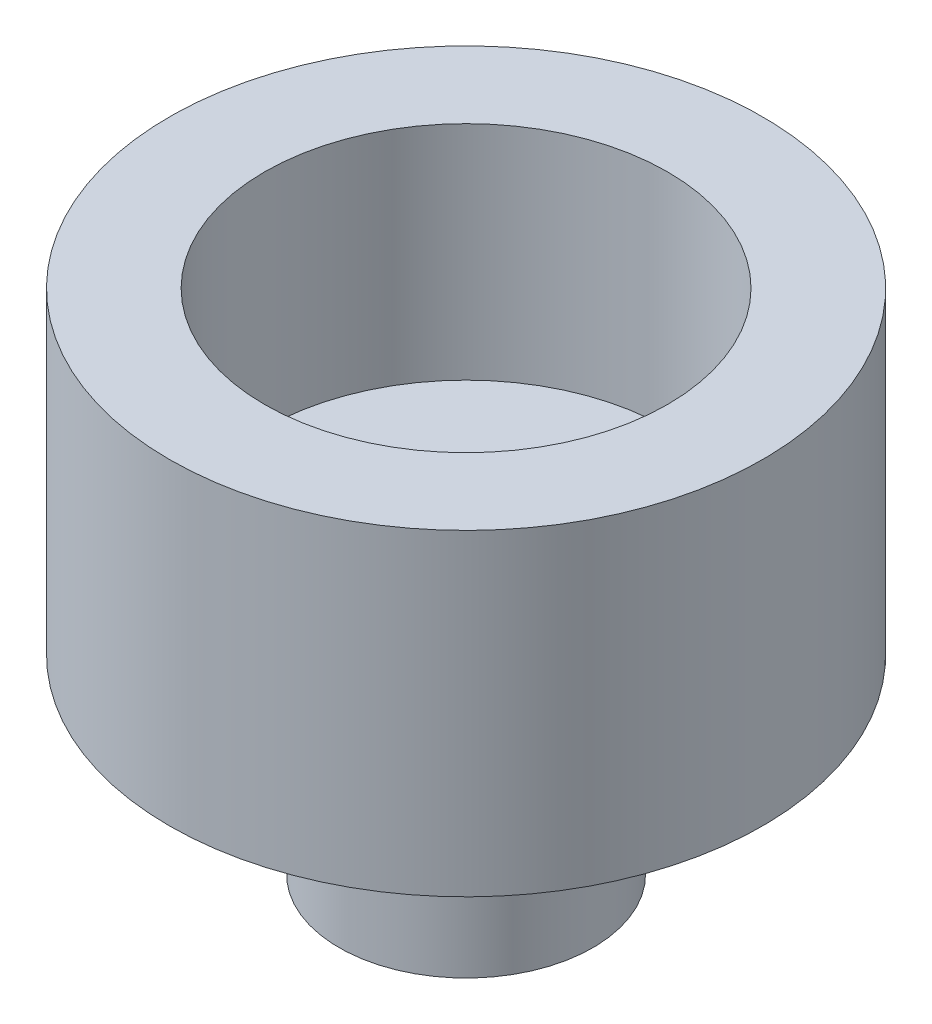
ISO-10303-21;
HEADER;
FILE_DESCRIPTION(('STEP AP214'),'2;1');
FILE_NAME('part.step','',(''),(''),'','','');
FILE_SCHEMA(('AUTOMOTIVE_DESIGN { 1 0 10303 214 1 1 1 1 }'));
ENDSEC;
DATA;
#1=APPLICATION_CONTEXT('core data for automotive mechanical design processes');
#2=APPLICATION_PROTOCOL_DEFINITION('international standard','automotive_design',2000,#1);
#3=PRODUCT_CONTEXT('',#1,'mechanical');
#4=PRODUCT('Part','Part','',(#3));
#5=PRODUCT_RELATED_PRODUCT_CATEGORY('part','',(#4));
#6=PRODUCT_DEFINITION_FORMATION('','',#4);
#7=PRODUCT_DEFINITION_CONTEXT('part definition',#1,'design');
#8=PRODUCT_DEFINITION('design','',#6,#7);
#9=PRODUCT_DEFINITION_SHAPE('','',#8);
#10=(LENGTH_UNIT() NAMED_UNIT(*) SI_UNIT(.MILLI.,.METRE.));
#11=(NAMED_UNIT(*) PLANE_ANGLE_UNIT() SI_UNIT($,.RADIAN.));
#12=(NAMED_UNIT(*) SI_UNIT($,.STERADIAN.) SOLID_ANGLE_UNIT());
#13=UNCERTAINTY_MEASURE_WITH_UNIT(LENGTH_MEASURE(1.E-05),#10,'distance_accuracy_value','');
#14=(GEOMETRIC_REPRESENTATION_CONTEXT(3) GLOBAL_UNCERTAINTY_ASSIGNED_CONTEXT((#13)) GLOBAL_UNIT_ASSIGNED_CONTEXT((#10,
#11,#12)) REPRESENTATION_CONTEXT('',''));
#15=CARTESIAN_POINT('',(0.,0.,0.));
#16=DIRECTION('',(0.,0.,1.));
#17=DIRECTION('',(1.,0.,0.));
#18=AXIS2_PLACEMENT_3D('',#15,#16,#17);
#19=CARTESIAN_POINT('',(0.,10.,0.));
#20=DIRECTION('',(0.,-1.,0.));
#21=DIRECTION('',(0.,0.,-1.));
#22=AXIS2_PLACEMENT_3D('',#19,#20,#21);
#23=CYLINDRICAL_SURFACE('',#22,9.35);
#24=CARTESIAN_POINT('',(0.,10.,0.));
#25=DIRECTION('',(0.,1.,0.));
#26=DIRECTION('',(0.,0.,1.));
#27=AXIS2_PLACEMENT_3D('',#24,#25,#26);
#28=CIRCLE('',#27,9.35);
#29=CARTESIAN_POINT('',(0.,10.,9.35));
#30=VERTEX_POINT('',#29);
#31=EDGE_CURVE('E47',#30,#30,#28,.T.);
#32=ORIENTED_EDGE('',*,*,#31,.F.);
#33=EDGE_LOOP('',(#32));
#34=FACE_BOUND('',#33,.T.);
#35=CARTESIAN_POINT('',(0.,0.,0.));
#36=DIRECTION('',(0.,1.,0.));
#37=DIRECTION('',(0.,0.,1.));
#38=AXIS2_PLACEMENT_3D('',#35,#36,#37);
#39=CIRCLE('',#38,9.35);
#40=CARTESIAN_POINT('',(0.,0.,9.35));
#41=VERTEX_POINT('',#40);
#42=EDGE_CURVE('E42',#41,#41,#39,.T.);
#43=ORIENTED_EDGE('',*,*,#42,.T.);
#44=EDGE_LOOP('',(#43));
#45=FACE_BOUND('',#44,.T.);
#46=ADVANCED_FACE('F39',(#34,#45),#23,.T.);
#47=CARTESIAN_POINT('',(0.,10.,0.));
#48=DIRECTION('',(0.,1.,0.));
#49=DIRECTION('',(0.,0.,1.));
#50=AXIS2_PLACEMENT_3D('',#47,#48,#49);
#51=PLANE('',#50);
#52=CARTESIAN_POINT('',(0.,10.,0.));
#53=DIRECTION('',(0.,1.,0.));
#54=DIRECTION('',(0.,0.,1.));
#55=AXIS2_PLACEMENT_3D('',#52,#53,#54);
#56=CIRCLE('',#55,6.35);
#57=CARTESIAN_POINT('',(0.,10.,6.35));
#58=VERTEX_POINT('',#57);
#59=EDGE_CURVE('E56',#58,#58,#56,.T.);
#60=ORIENTED_EDGE('',*,*,#59,.F.);
#61=EDGE_LOOP('',(#60));
#62=FACE_BOUND('',#61,.T.);
#63=ORIENTED_EDGE('',*,*,#31,.T.);
#64=EDGE_LOOP('',(#63));
#65=FACE_BOUND('',#64,.T.);
#66=ADVANCED_FACE('F73',(#62,#65),#51,.T.);
#67=CARTESIAN_POINT('',(0.,0.,0.));
#68=DIRECTION('',(0.,1.,0.));
#69=DIRECTION('',(0.,0.,1.));
#70=AXIS2_PLACEMENT_3D('',#67,#68,#69);
#71=PLANE('',#70);
#72=CARTESIAN_POINT('',(0.,0.,0.));
#73=DIRECTION('',(0.,-1.,0.));
#74=DIRECTION('',(0.,0.,-1.));
#75=AXIS2_PLACEMENT_3D('',#72,#73,#74);
#76=CIRCLE('',#75,4.);
#77=CARTESIAN_POINT('',(0.,0.,-4.));
#78=VERTEX_POINT('',#77);
#79=EDGE_CURVE('E11',#78,#78,#76,.T.);
#80=ORIENTED_EDGE('',*,*,#79,.F.);
#81=EDGE_LOOP('',(#80));
#82=FACE_BOUND('',#81,.T.);
#83=ORIENTED_EDGE('',*,*,#42,.F.);
#84=EDGE_LOOP('',(#83));
#85=FACE_BOUND('',#84,.T.);
#86=ADVANCED_FACE('F70',(#82,#85),#71,.F.);
#87=CARTESIAN_POINT('',(0.,-17.9605122421383,0.));
#88=DIRECTION('',(0.,1.,0.));
#89=DIRECTION('',(0.,0.,1.));
#90=AXIS2_PLACEMENT_3D('',#87,#88,#89);
#91=CYLINDRICAL_SURFACE('',#90,6.35);
#92=CARTESIAN_POINT('',(0.,3.,0.));
#93=DIRECTION('',(0.,1.,0.));
#94=DIRECTION('',(0.,0.,1.));
#95=AXIS2_PLACEMENT_3D('',#92,#93,#94);
#96=CIRCLE('',#95,6.35);
#97=CARTESIAN_POINT('',(0.,3.,6.35));
#98=VERTEX_POINT('',#97);
#99=EDGE_CURVE('E60',#98,#98,#96,.F.);
#100=ORIENTED_EDGE('',*,*,#99,.T.);
#101=EDGE_LOOP('',(#100));
#102=FACE_BOUND('',#101,.T.);
#103=ORIENTED_EDGE('',*,*,#59,.T.);
#104=EDGE_LOOP('',(#103));
#105=FACE_BOUND('',#104,.T.);
#106=ADVANCED_FACE('F72',(#102,#105),#91,.F.);
#107=CARTESIAN_POINT('',(0.,3.,0.));
#108=DIRECTION('',(0.,1.,0.));
#109=DIRECTION('',(0.,0.,1.));
#110=AXIS2_PLACEMENT_3D('',#107,#108,#109);
#111=PLANE('',#110);
#112=ORIENTED_EDGE('',*,*,#99,.F.);
#113=EDGE_LOOP('',(#112));
#114=FACE_BOUND('',#113,.T.);
#115=ADVANCED_FACE('F79',(#114),#111,.T.);
#116=CARTESIAN_POINT('',(0.,-6.,0.));
#117=DIRECTION('',(0.,1.,0.));
#118=DIRECTION('',(0.,0.,1.));
#119=AXIS2_PLACEMENT_3D('',#116,#117,#118);
#120=CYLINDRICAL_SURFACE('',#119,4.);
#121=CARTESIAN_POINT('',(0.,-6.,0.));
#122=DIRECTION('',(0.,-1.,0.));
#123=DIRECTION('',(0.,0.,-1.));
#124=AXIS2_PLACEMENT_3D('',#121,#122,#123);
#125=CIRCLE('',#124,4.);
#126=CARTESIAN_POINT('',(0.,-6.,-4.));
#127=VERTEX_POINT('',#126);
#128=EDGE_CURVE('E55',#127,#127,#125,.T.);
#129=ORIENTED_EDGE('',*,*,#128,.F.);
#130=EDGE_LOOP('',(#129));
#131=FACE_BOUND('',#130,.T.);
#132=ORIENTED_EDGE('',*,*,#79,.T.);
#133=EDGE_LOOP('',(#132));
#134=FACE_BOUND('',#133,.T.);
#135=ADVANCED_FACE('F108',(#131,#134),#120,.T.);
#136=CARTESIAN_POINT('',(0.,-6.,0.));
#137=DIRECTION('',(0.,-1.,0.));
#138=DIRECTION('',(0.,0.,-1.));
#139=AXIS2_PLACEMENT_3D('',#136,#137,#138);
#140=PLANE('',#139);
#141=ORIENTED_EDGE('',*,*,#128,.T.);
#142=EDGE_LOOP('',(#141));
#143=FACE_BOUND('',#142,.T.);
#144=ADVANCED_FACE('F122',(#143),#140,.T.);
#145=CLOSED_SHELL('',(#46,#66,#86,#106,#115,#135,#144));
#146=MANIFOLD_SOLID_BREP('B2',#145);
#147=ADVANCED_BREP_SHAPE_REPRESENTATION('',(#18,#146),#14);
#148=SHAPE_DEFINITION_REPRESENTATION(#9,#147);
ENDSEC;
END-ISO-10303-21;
